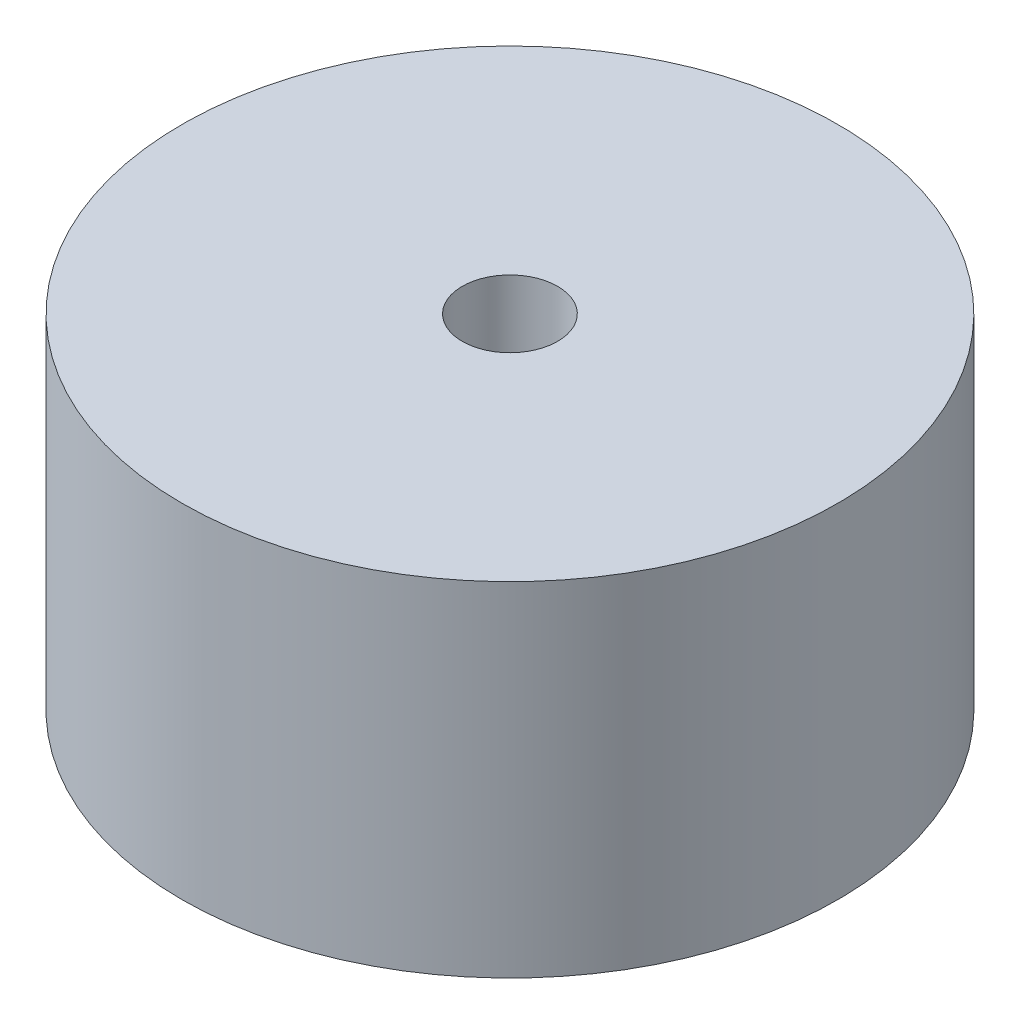
ISO-10303-21;
HEADER;
FILE_DESCRIPTION(('STEP AP214'),'2;1');
FILE_NAME('part.step','',(''),(''),'','','');
FILE_SCHEMA(('AUTOMOTIVE_DESIGN { 1 0 10303 214 1 1 1 1 }'));
ENDSEC;
DATA;
#1=APPLICATION_CONTEXT('core data for automotive mechanical design processes');
#2=APPLICATION_PROTOCOL_DEFINITION('international standard','automotive_design',2000,#1);
#3=PRODUCT_CONTEXT('',#1,'mechanical');
#4=PRODUCT('Part','Part','',(#3));
#5=PRODUCT_RELATED_PRODUCT_CATEGORY('part','',(#4));
#6=PRODUCT_DEFINITION_FORMATION('','',#4);
#7=PRODUCT_DEFINITION_CONTEXT('part definition',#1,'design');
#8=PRODUCT_DEFINITION('design','',#6,#7);
#9=PRODUCT_DEFINITION_SHAPE('','',#8);
#10=(LENGTH_UNIT() NAMED_UNIT(*) SI_UNIT(.MILLI.,.METRE.));
#11=(NAMED_UNIT(*) PLANE_ANGLE_UNIT() SI_UNIT($,.RADIAN.));
#12=(NAMED_UNIT(*) SI_UNIT($,.STERADIAN.) SOLID_ANGLE_UNIT());
#13=UNCERTAINTY_MEASURE_WITH_UNIT(LENGTH_MEASURE(1.E-05),#10,'distance_accuracy_value','');
#14=(GEOMETRIC_REPRESENTATION_CONTEXT(3) GLOBAL_UNCERTAINTY_ASSIGNED_CONTEXT((#13)) GLOBAL_UNIT_ASSIGNED_CONTEXT((#10,
#11,#12)) REPRESENTATION_CONTEXT('',''));
#15=CARTESIAN_POINT('',(0.,0.,0.));
#16=DIRECTION('',(0.,0.,1.));
#17=DIRECTION('',(1.,0.,0.));
#18=AXIS2_PLACEMENT_3D('',#15,#16,#17);
#19=CARTESIAN_POINT('',(0.,36.,0.));
#20=DIRECTION('',(0.,-1.,0.));
#21=DIRECTION('',(0.,0.,-1.));
#22=AXIS2_PLACEMENT_3D('',#19,#20,#21);
#23=CYLINDRICAL_SURFACE('',#22,34.4);
#24=CARTESIAN_POINT('',(0.,36.,0.));
#25=DIRECTION('',(0.,1.,0.));
#26=DIRECTION('',(0.,0.,1.));
#27=AXIS2_PLACEMENT_3D('',#24,#25,#26);
#28=CIRCLE('',#27,34.4);
#29=CARTESIAN_POINT('',(0.,36.,34.4));
#30=VERTEX_POINT('',#29);
#31=EDGE_CURVE('E10',#30,#30,#28,.T.);
#32=ORIENTED_EDGE('',*,*,#31,.F.);
#33=EDGE_LOOP('',(#32));
#34=FACE_BOUND('',#33,.T.);
#35=CARTESIAN_POINT('',(0.,0.,0.));
#36=DIRECTION('',(0.,1.,0.));
#37=DIRECTION('',(0.,0.,1.));
#38=AXIS2_PLACEMENT_3D('',#35,#36,#37);
#39=CIRCLE('',#38,34.4);
#40=CARTESIAN_POINT('',(0.,0.,34.4));
#41=VERTEX_POINT('',#40);
#42=EDGE_CURVE('E42',#41,#41,#39,.T.);
#43=ORIENTED_EDGE('',*,*,#42,.T.);
#44=EDGE_LOOP('',(#43));
#45=FACE_BOUND('',#44,.T.);
#46=ADVANCED_FACE('F39',(#34,#45),#23,.T.);
#47=CARTESIAN_POINT('',(0.,36.,0.));
#48=DIRECTION('',(0.,1.,0.));
#49=DIRECTION('',(0.,0.,1.));
#50=AXIS2_PLACEMENT_3D('',#47,#48,#49);
#51=PLANE('',#50);
#52=CARTESIAN_POINT('',(0.,36.,0.));
#53=DIRECTION('',(0.,-1.,0.));
#54=DIRECTION('',(0.,0.,-1.));
#55=AXIS2_PLACEMENT_3D('',#52,#53,#54);
#56=CIRCLE('',#55,5.000000033);
#57=CARTESIAN_POINT('',(0.,36.,-5.000000033));
#58=VERTEX_POINT('',#57);
#59=EDGE_CURVE('E49',#58,#58,#56,.T.);
#60=ORIENTED_EDGE('',*,*,#59,.T.);
#61=EDGE_LOOP('',(#60));
#62=FACE_BOUND('',#61,.T.);
#63=ORIENTED_EDGE('',*,*,#31,.T.);
#64=EDGE_LOOP('',(#63));
#65=FACE_BOUND('',#64,.T.);
#66=ADVANCED_FACE('F57',(#62,#65),#51,.T.);
#67=CARTESIAN_POINT('',(0.,0.,0.));
#68=DIRECTION('',(0.,1.,0.));
#69=DIRECTION('',(0.,0.,1.));
#70=AXIS2_PLACEMENT_3D('',#67,#68,#69);
#71=PLANE('',#70);
#72=CARTESIAN_POINT('',(0.,0.,0.));
#73=DIRECTION('',(0.,-1.,0.));
#74=DIRECTION('',(0.,0.,-1.));
#75=AXIS2_PLACEMENT_3D('',#72,#73,#74);
#76=CIRCLE('',#75,5.000000033);
#77=CARTESIAN_POINT('',(0.,0.,-5.000000033));
#78=VERTEX_POINT('',#77);
#79=EDGE_CURVE('E51',#78,#78,#76,.T.);
#80=ORIENTED_EDGE('',*,*,#79,.F.);
#81=EDGE_LOOP('',(#80));
#82=FACE_BOUND('',#81,.T.);
#83=ORIENTED_EDGE('',*,*,#42,.F.);
#84=EDGE_LOOP('',(#83));
#85=FACE_BOUND('',#84,.T.);
#86=ADVANCED_FACE('F62',(#82,#85),#71,.F.);
#87=CARTESIAN_POINT('',(0.,36.,0.));
#88=DIRECTION('',(0.,-1.,0.));
#89=DIRECTION('',(0.,0.,-1.));
#90=AXIS2_PLACEMENT_3D('',#87,#88,#89);
#91=CYLINDRICAL_SURFACE('',#90,5.000000033);
#92=ORIENTED_EDGE('',*,*,#59,.F.);
#93=EDGE_LOOP('',(#92));
#94=FACE_BOUND('',#93,.T.);
#95=ORIENTED_EDGE('',*,*,#79,.T.);
#96=EDGE_LOOP('',(#95));
#97=FACE_BOUND('',#96,.T.);
#98=ADVANCED_FACE('F59',(#94,#97),#91,.F.);
#99=CLOSED_SHELL('',(#46,#66,#86,#98));
#100=MANIFOLD_SOLID_BREP('B2',#99);
#101=ADVANCED_BREP_SHAPE_REPRESENTATION('',(#18,#100),#14);
#102=SHAPE_DEFINITION_REPRESENTATION(#9,#101);
ENDSEC;
END-ISO-10303-21;
